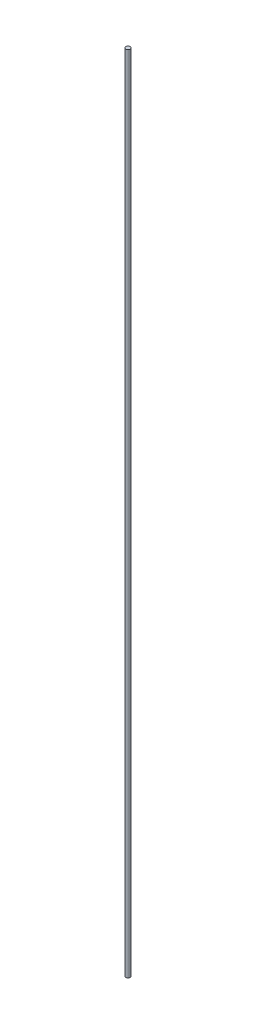
ISO-10303-21;
HEADER;
FILE_DESCRIPTION(('STEP AP214'),'2;1');
FILE_NAME('part.step','',(''),(''),'','','');
FILE_SCHEMA(('AUTOMOTIVE_DESIGN { 1 0 10303 214 1 1 1 1 }'));
ENDSEC;
DATA;
#1=APPLICATION_CONTEXT('core data for automotive mechanical design processes');
#2=APPLICATION_PROTOCOL_DEFINITION('international standard','automotive_design',2000,#1);
#3=PRODUCT_CONTEXT('',#1,'mechanical');
#4=PRODUCT('Part','Part','',(#3));
#5=PRODUCT_RELATED_PRODUCT_CATEGORY('part','',(#4));
#6=PRODUCT_DEFINITION_FORMATION('','',#4);
#7=PRODUCT_DEFINITION_CONTEXT('part definition',#1,'design');
#8=PRODUCT_DEFINITION('design','',#6,#7);
#9=PRODUCT_DEFINITION_SHAPE('','',#8);
#10=(LENGTH_UNIT() NAMED_UNIT(*) SI_UNIT(.MILLI.,.METRE.));
#11=(NAMED_UNIT(*) PLANE_ANGLE_UNIT() SI_UNIT($,.RADIAN.));
#12=(NAMED_UNIT(*) SI_UNIT($,.STERADIAN.) SOLID_ANGLE_UNIT());
#13=UNCERTAINTY_MEASURE_WITH_UNIT(LENGTH_MEASURE(1.E-05),#10,'distance_accuracy_value','');
#14=(GEOMETRIC_REPRESENTATION_CONTEXT(3) GLOBAL_UNCERTAINTY_ASSIGNED_CONTEXT((#13)) GLOBAL_UNIT_ASSIGNED_CONTEXT((#10,
#11,#12)) REPRESENTATION_CONTEXT('',''));
#15=CARTESIAN_POINT('',(0.,0.,0.));
#16=DIRECTION('',(0.,0.,1.));
#17=DIRECTION('',(1.,0.,0.));
#18=AXIS2_PLACEMENT_3D('',#15,#16,#17);
#19=CARTESIAN_POINT('',(0.,1400.,0.));
#20=DIRECTION('',(0.,-1.,0.));
#21=DIRECTION('',(0.,0.,-1.));
#22=AXIS2_PLACEMENT_3D('',#19,#20,#21);
#23=CYLINDRICAL_SURFACE('',#22,4.);
#24=CARTESIAN_POINT('',(0.,1400.,0.));
#25=DIRECTION('',(0.,1.,0.));
#26=DIRECTION('',(0.,0.,1.));
#27=AXIS2_PLACEMENT_3D('',#24,#25,#26);
#28=CIRCLE('',#27,4.);
#29=CARTESIAN_POINT('',(0.,1400.,4.));
#30=VERTEX_POINT('',#29);
#31=EDGE_CURVE('E10',#30,#30,#28,.T.);
#32=ORIENTED_EDGE('',*,*,#31,.F.);
#33=EDGE_LOOP('',(#32));
#34=FACE_BOUND('',#33,.T.);
#35=CARTESIAN_POINT('',(0.,0.,0.));
#36=DIRECTION('',(0.,1.,0.));
#37=DIRECTION('',(0.,0.,1.));
#38=AXIS2_PLACEMENT_3D('',#35,#36,#37);
#39=CIRCLE('',#38,4.);
#40=CARTESIAN_POINT('',(0.,0.,4.));
#41=VERTEX_POINT('',#40);
#42=EDGE_CURVE('E34',#41,#41,#39,.T.);
#43=ORIENTED_EDGE('',*,*,#42,.T.);
#44=EDGE_LOOP('',(#43));
#45=FACE_BOUND('',#44,.T.);
#46=ADVANCED_FACE('F31',(#34,#45),#23,.T.);
#47=CARTESIAN_POINT('',(0.,1400.,0.));
#48=DIRECTION('',(0.,1.,0.));
#49=DIRECTION('',(0.,0.,1.));
#50=AXIS2_PLACEMENT_3D('',#47,#48,#49);
#51=PLANE('',#50);
#52=ORIENTED_EDGE('',*,*,#31,.T.);
#53=EDGE_LOOP('',(#52));
#54=FACE_BOUND('',#53,.T.);
#55=ADVANCED_FACE('F46',(#54),#51,.T.);
#56=CARTESIAN_POINT('',(0.,0.,0.));
#57=DIRECTION('',(0.,1.,0.));
#58=DIRECTION('',(0.,0.,1.));
#59=AXIS2_PLACEMENT_3D('',#56,#57,#58);
#60=PLANE('',#59);
#61=ORIENTED_EDGE('',*,*,#42,.F.);
#62=EDGE_LOOP('',(#61));
#63=FACE_BOUND('',#62,.T.);
#64=ADVANCED_FACE('F44',(#63),#60,.F.);
#65=CLOSED_SHELL('',(#46,#55,#64));
#66=MANIFOLD_SOLID_BREP('B2',#65);
#67=ADVANCED_BREP_SHAPE_REPRESENTATION('',(#18,#66),#14);
#68=SHAPE_DEFINITION_REPRESENTATION(#9,#67);
ENDSEC;
END-ISO-10303-21;
